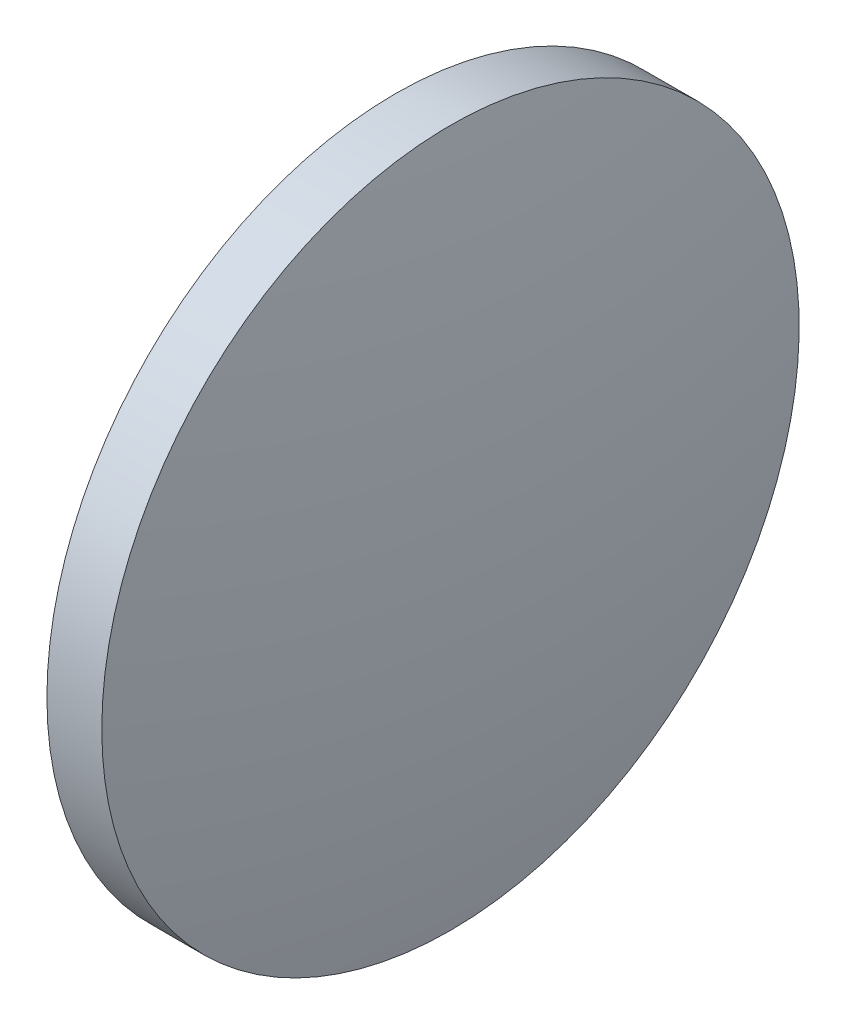
ISO-10303-21;
HEADER;
FILE_DESCRIPTION(('STEP AP214'),'2;1');
FILE_NAME('part.step','',(''),(''),'','','');
FILE_SCHEMA(('AUTOMOTIVE_DESIGN { 1 0 10303 214 1 1 1 1 }'));
ENDSEC;
DATA;
#1=APPLICATION_CONTEXT('core data for automotive mechanical design processes');
#2=APPLICATION_PROTOCOL_DEFINITION('international standard','automotive_design',2000,#1);
#3=PRODUCT_CONTEXT('',#1,'mechanical');
#4=PRODUCT('Part','Part','',(#3));
#5=PRODUCT_RELATED_PRODUCT_CATEGORY('part','',(#4));
#6=PRODUCT_DEFINITION_FORMATION('','',#4);
#7=PRODUCT_DEFINITION_CONTEXT('part definition',#1,'design');
#8=PRODUCT_DEFINITION('design','',#6,#7);
#9=PRODUCT_DEFINITION_SHAPE('','',#8);
#10=(LENGTH_UNIT() NAMED_UNIT(*) SI_UNIT(.MILLI.,.METRE.));
#11=(NAMED_UNIT(*) PLANE_ANGLE_UNIT() SI_UNIT($,.RADIAN.));
#12=(NAMED_UNIT(*) SI_UNIT($,.STERADIAN.) SOLID_ANGLE_UNIT());
#13=UNCERTAINTY_MEASURE_WITH_UNIT(LENGTH_MEASURE(1.E-05),#10,'distance_accuracy_value','');
#14=(GEOMETRIC_REPRESENTATION_CONTEXT(3) GLOBAL_UNCERTAINTY_ASSIGNED_CONTEXT((#13)) GLOBAL_UNIT_ASSIGNED_CONTEXT((#10,
#11,#12)) REPRESENTATION_CONTEXT('',''));
#15=CARTESIAN_POINT('',(0.,0.,0.));
#16=DIRECTION('',(0.,0.,1.));
#17=DIRECTION('',(1.,0.,0.));
#18=AXIS2_PLACEMENT_3D('',#15,#16,#17);
#19=CARTESIAN_POINT('',(154.991574111349,48.6161130231847,0.));
#20=DIRECTION('',(-1.,0.,0.));
#21=DIRECTION('',(0.,1.,0.));
#22=AXIS2_PLACEMENT_3D('',#19,#20,#21);
#23=SPHERICAL_SURFACE('',#22,70.6833451938293);
#24=CARTESIAN_POINT('',(85.4585223460911,48.6161130231848,0.));
#25=DIRECTION('',(-1.,0.,0.));
#26=DIRECTION('',(0.,0.,1.));
#27=AXIS2_PLACEMENT_3D('',#24,#25,#26);
#28=CIRCLE('',#27,12.7);
#29=CARTESIAN_POINT('',(85.4585223460911,48.6161130231848,12.7));
#30=VERTEX_POINT('',#29);
#31=EDGE_CURVE('E46',#30,#30,#28,.T.);
#32=ORIENTED_EDGE('',*,*,#31,.T.);
#33=EDGE_LOOP('',(#32));
#34=FACE_BOUND('',#33,.T.);
#35=ADVANCED_FACE('F39',(#34),#23,.T.);
#36=CARTESIAN_POINT('',(17.9248134379769,48.6161130231848,0.));
#37=DIRECTION('',(-1.,0.,0.));
#38=DIRECTION('',(0.,-1.,0.));
#39=AXIS2_PLACEMENT_3D('',#36,#37,#38);
#40=SPHERICAL_SURFACE('',#39,70.6833451938285);
#41=CARTESIAN_POINT('',(87.457865203234,48.6161130231848,0.));
#42=DIRECTION('',(-1.,0.,0.));
#43=DIRECTION('',(0.,0.,1.));
#44=AXIS2_PLACEMENT_3D('',#41,#42,#43);
#45=CIRCLE('',#44,12.7);
#46=CARTESIAN_POINT('',(87.457865203234,48.6161130231848,12.7));
#47=VERTEX_POINT('',#46);
#48=EDGE_CURVE('E10',#47,#47,#45,.T.);
#49=ORIENTED_EDGE('',*,*,#48,.F.);
#50=EDGE_LOOP('',(#49));
#51=FACE_BOUND('',#50,.T.);
#52=ADVANCED_FACE('F56',(#51),#40,.T.);
#53=CARTESIAN_POINT('',(79.3054013508372,48.6161130231848,0.));
#54=DIRECTION('',(-1.,0.,0.));
#55=DIRECTION('',(0.,0.,1.));
#56=AXIS2_PLACEMENT_3D('',#53,#54,#55);
#57=CYLINDRICAL_SURFACE('',#56,12.7);
#58=ORIENTED_EDGE('',*,*,#48,.T.);
#59=EDGE_LOOP('',(#58));
#60=FACE_BOUND('',#59,.T.);
#61=ORIENTED_EDGE('',*,*,#31,.F.);
#62=EDGE_LOOP('',(#61));
#63=FACE_BOUND('',#62,.T.);
#64=ADVANCED_FACE('F54',(#60,#63),#57,.T.);
#65=CLOSED_SHELL('',(#35,#52,#64));
#66=MANIFOLD_SOLID_BREP('B2',#65);
#67=ADVANCED_BREP_SHAPE_REPRESENTATION('',(#18,#66),#14);
#68=SHAPE_DEFINITION_REPRESENTATION(#9,#67);
ENDSEC;
END-ISO-10303-21;
